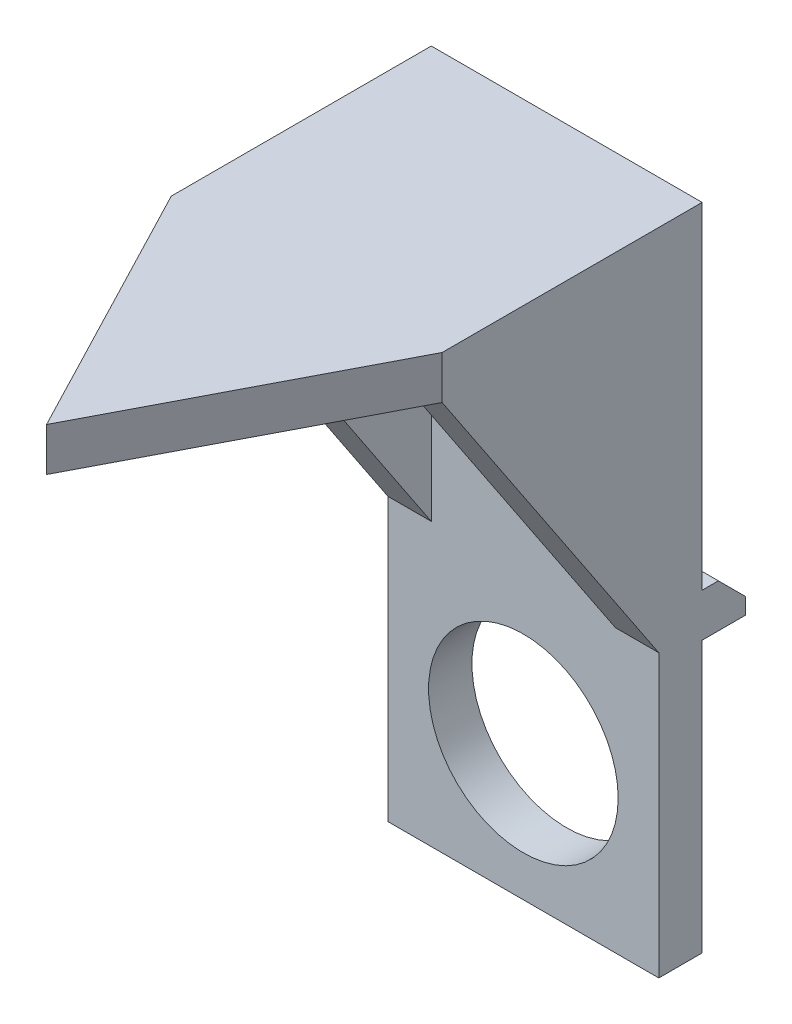
ISO-10303-21;
HEADER;
FILE_DESCRIPTION(('STEP AP214'),'2;1');
FILE_NAME('part.step','',(''),(''),'','','');
FILE_SCHEMA(('AUTOMOTIVE_DESIGN { 1 0 10303 214 1 1 1 1 }'));
ENDSEC;
DATA;
#1=APPLICATION_CONTEXT('core data for automotive mechanical design processes');
#2=APPLICATION_PROTOCOL_DEFINITION('international standard','automotive_design',2000,#1);
#3=PRODUCT_CONTEXT('',#1,'mechanical');
#4=PRODUCT('Part','Part','',(#3));
#5=PRODUCT_RELATED_PRODUCT_CATEGORY('part','',(#4));
#6=PRODUCT_DEFINITION_FORMATION('','',#4);
#7=PRODUCT_DEFINITION_CONTEXT('part definition',#1,'design');
#8=PRODUCT_DEFINITION('design','',#6,#7);
#9=PRODUCT_DEFINITION_SHAPE('','',#8);
#10=(LENGTH_UNIT() NAMED_UNIT(*) SI_UNIT(.MILLI.,.METRE.));
#11=(NAMED_UNIT(*) PLANE_ANGLE_UNIT() SI_UNIT($,.RADIAN.));
#12=(NAMED_UNIT(*) SI_UNIT($,.STERADIAN.) SOLID_ANGLE_UNIT());
#13=UNCERTAINTY_MEASURE_WITH_UNIT(LENGTH_MEASURE(1.E-05),#10,'distance_accuracy_value','');
#14=(GEOMETRIC_REPRESENTATION_CONTEXT(3) GLOBAL_UNCERTAINTY_ASSIGNED_CONTEXT((#13)) GLOBAL_UNIT_ASSIGNED_CONTEXT((#10,
#11,#12)) REPRESENTATION_CONTEXT('',''));
#15=CARTESIAN_POINT('',(0.,0.,0.));
#16=DIRECTION('',(0.,0.,1.));
#17=DIRECTION('',(1.,0.,0.));
#18=AXIS2_PLACEMENT_3D('',#15,#16,#17);
#19=CARTESIAN_POINT('',(0.,0.,0.));
#20=DIRECTION('',(0.,0.,1.));
#21=DIRECTION('',(1.,0.,0.));
#22=AXIS2_PLACEMENT_3D('',#19,#20,#21);
#23=PLANE('',#22);
#24=DIRECTION('',(1.,0.,0.));
#25=VECTOR('',#24,1.);
#26=CARTESIAN_POINT('',(5.00000000000002,6.59999999999999,0.));
#27=LINE('',#26,#25);
#28=CARTESIAN_POINT('',(-5.00000000000003,6.59999999999999,0.));
#29=VERTEX_POINT('',#28);
#30=CARTESIAN_POINT('',(5.00000000000002,6.59999999999999,0.));
#31=VERTEX_POINT('',#30);
#32=EDGE_CURVE('E244',#29,#31,#27,.T.);
#33=ORIENTED_EDGE('',*,*,#32,.F.);
#34=DIRECTION('',(0.,-1.,0.));
#35=VECTOR('',#34,1.);
#36=CARTESIAN_POINT('',(-5.00000000000004,19.,0.));
#37=LINE('',#36,#35);
#38=CARTESIAN_POINT('',(-5.00000000000004,19.,0.));
#39=VERTEX_POINT('',#38);
#40=EDGE_CURVE('E227',#39,#29,#37,.T.);
#41=ORIENTED_EDGE('',*,*,#40,.F.);
#42=DIRECTION('',(-1.,0.,0.));
#43=VECTOR('',#42,1.);
#44=CARTESIAN_POINT('',(-5.00000000000004,19.,0.));
#45=LINE('',#44,#43);
#46=CARTESIAN_POINT('',(5.,19.,0.));
#47=VERTEX_POINT('',#46);
#48=EDGE_CURVE('E273',#47,#39,#45,.T.);
#49=ORIENTED_EDGE('',*,*,#48,.F.);
#50=DIRECTION('',(0.,1.,0.));
#51=VECTOR('',#50,1.);
#52=CARTESIAN_POINT('',(5.,19.,0.));
#53=LINE('',#52,#51);
#54=EDGE_CURVE('E182',#31,#47,#53,.T.);
#55=ORIENTED_EDGE('',*,*,#54,.F.);
#56=EDGE_LOOP('',(#33,#41,#49,#55));
#57=FACE_BOUND('',#56,.T.);
#58=ADVANCED_FACE('F45',(#57),#23,.F.);
#59=CARTESIAN_POINT('',(0.,0.,0.));
#60=DIRECTION('',(0.,0.,1.));
#61=DIRECTION('',(1.,0.,0.));
#62=AXIS2_PLACEMENT_3D('',#59,#60,#61);
#63=CIRCLE('',#62,3.5);
#64=CARTESIAN_POINT('',(3.50000000000001,0.,0.));
#65=VERTEX_POINT('',#64);
#66=EDGE_CURVE('E253',#65,#65,#63,.T.);
#67=ORIENTED_EDGE('',*,*,#66,.T.);
#68=EDGE_LOOP('',(#67));
#69=FACE_BOUND('',#68,.T.);
#70=DIRECTION('',(-1.,0.,0.));
#71=VECTOR('',#70,1.);
#72=CARTESIAN_POINT('',(5.00000000000002,5.,0.));
#73=LINE('',#72,#71);
#74=CARTESIAN_POINT('',(5.00000000000002,5.,0.));
#75=VERTEX_POINT('',#74);
#76=CARTESIAN_POINT('',(-5.00000000000003,5.,0.));
#77=VERTEX_POINT('',#76);
#78=EDGE_CURVE('E250',#75,#77,#73,.T.);
#79=ORIENTED_EDGE('',*,*,#78,.F.);
#80=CARTESIAN_POINT('',(5.00000000000002,-5.00000000000001,0.));
#81=VERTEX_POINT('',#80);
#82=EDGE_CURVE('E284',#81,#75,#53,.T.);
#83=ORIENTED_EDGE('',*,*,#82,.F.);
#84=DIRECTION('',(1.,0.,0.));
#85=VECTOR('',#84,1.);
#86=CARTESIAN_POINT('',(-5.00000000000003,-5.,0.));
#87=LINE('',#86,#85);
#88=CARTESIAN_POINT('',(-5.00000000000003,-5.,0.));
#89=VERTEX_POINT('',#88);
#90=EDGE_CURVE('E281',#89,#81,#87,.T.);
#91=ORIENTED_EDGE('',*,*,#90,.F.);
#92=EDGE_CURVE('E268',#77,#89,#37,.T.);
#93=ORIENTED_EDGE('',*,*,#92,.F.);
#94=EDGE_LOOP('',(#79,#83,#91,#93));
#95=FACE_BOUND('',#94,.T.);
#96=ADVANCED_FACE('F308',(#69,#95),#23,.F.);
#97=CARTESIAN_POINT('',(-5.,19.,1.60000000000005));
#98=DIRECTION('',(1.,0.,0.));
#99=DIRECTION('',(0.,1.,0.));
#100=AXIS2_PLACEMENT_3D('',#97,#98,#99);
#101=PLANE('',#100);
#102=DIRECTION('',(0.,0.832050294337844,0.554700196225231));
#103=VECTOR('',#102,1.);
#104=CARTESIAN_POINT('',(-5.00000000000002,17.4,9.60000000000002));
#105=LINE('',#104,#103);
#106=CARTESIAN_POINT('',(-5.,5.4,1.60000000000005));
#107=VERTEX_POINT('',#106);
#108=CARTESIAN_POINT('',(-5.00000000000002,17.4,9.60000000000002));
#109=VERTEX_POINT('',#108);
#110=EDGE_CURVE('E322',#107,#109,#105,.T.);
#111=ORIENTED_EDGE('',*,*,#110,.T.);
#112=DIRECTION('',(0.,-1.,0.));
#113=VECTOR('',#112,1.);
#114=CARTESIAN_POINT('',(-5.00000000000002,19.,9.60000000000002));
#115=LINE('',#114,#113);
#116=CARTESIAN_POINT('',(-5.00000000000002,19.,9.60000000000002));
#117=VERTEX_POINT('',#116);
#118=EDGE_CURVE('E323',#117,#109,#115,.T.);
#119=ORIENTED_EDGE('',*,*,#118,.F.);
#120=DIRECTION('',(0.,0.,-1.));
#121=VECTOR('',#120,1.);
#122=CARTESIAN_POINT('',(-5.,19.,1.60000000000005));
#123=LINE('',#122,#121);
#124=EDGE_CURVE('E186',#117,#39,#123,.T.);
#125=ORIENTED_EDGE('',*,*,#124,.T.);
#126=ORIENTED_EDGE('',*,*,#40,.T.);
#127=DIRECTION('',(0.,0.,1.));
#128=VECTOR('',#127,1.);
#129=CARTESIAN_POINT('',(-5.00000000000004,6.59999999999999,-1.59999999999999));
#130=LINE('',#129,#128);
#131=CARTESIAN_POINT('',(-5.00000000000001,6.59999999999999,-0.599999999999962));
#132=VERTEX_POINT('',#131);
#133=EDGE_CURVE('E215',#132,#29,#130,.T.);
#134=ORIENTED_EDGE('',*,*,#133,.F.);
#135=DIRECTION('',(0.,-0.707106781186548,-0.707106781186549));
#136=VECTOR('',#135,1.);
#137=CARTESIAN_POINT('',(-4.99999999999998,5.59999999999999,-1.59999999999999));
#138=LINE('',#137,#136);
#139=CARTESIAN_POINT('',(-5.00000000000002,5.59999999999999,-1.59999999999999));
#140=VERTEX_POINT('',#139);
#141=EDGE_CURVE('E11',#132,#140,#138,.T.);
#142=ORIENTED_EDGE('',*,*,#141,.T.);
#143=DIRECTION('',(0.,1.,0.));
#144=VECTOR('',#143,1.);
#145=CARTESIAN_POINT('',(-5.00000000000004,6.59999999999999,-1.59999999999999));
#146=LINE('',#145,#144);
#147=CARTESIAN_POINT('',(-5.00000000000002,5.,-1.59999999999999));
#148=VERTEX_POINT('',#147);
#149=EDGE_CURVE('E237',#148,#140,#146,.T.);
#150=ORIENTED_EDGE('',*,*,#149,.F.);
#151=DIRECTION('',(0.,0.,1.));
#152=VECTOR('',#151,1.);
#153=CARTESIAN_POINT('',(-5.00000000000002,5.,-1.59999999999999));
#154=LINE('',#153,#152);
#155=EDGE_CURVE('E229',#148,#77,#154,.T.);
#156=ORIENTED_EDGE('',*,*,#155,.T.);
#157=ORIENTED_EDGE('',*,*,#92,.T.);
#158=DIRECTION('',(0.,0.,-1.));
#159=VECTOR('',#158,1.);
#160=CARTESIAN_POINT('',(-4.99999999999996,-5.,1.6000000000001));
#161=LINE('',#160,#159);
#162=CARTESIAN_POINT('',(-4.99999999999996,-5.,1.6000000000001));
#163=VERTEX_POINT('',#162);
#164=EDGE_CURVE('E192',#163,#89,#161,.T.);
#165=ORIENTED_EDGE('',*,*,#164,.F.);
#166=DIRECTION('',(0.,-1.,0.));
#167=VECTOR('',#166,1.);
#168=CARTESIAN_POINT('',(-5.,19.,1.60000000000005));
#169=LINE('',#168,#167);
#170=EDGE_CURVE('E269',#107,#163,#169,.T.);
#171=ORIENTED_EDGE('',*,*,#170,.F.);
#172=EDGE_LOOP('',(#111,#119,#125,#126,#134,#142,#150,#156,#157,#165,#171));
#173=FACE_BOUND('',#172,.T.);
#174=ADVANCED_FACE('F223',(#173),#101,.F.);
#175=CARTESIAN_POINT('',(-4.99999999999996,-5.,1.6000000000001));
#176=DIRECTION('',(0.,1.,0.));
#177=DIRECTION('',(0.,0.,1.));
#178=AXIS2_PLACEMENT_3D('',#175,#176,#177);
#179=PLANE('',#178);
#180=ORIENTED_EDGE('',*,*,#90,.T.);
#181=DIRECTION('',(0.,0.,-1.));
#182=VECTOR('',#181,1.);
#183=CARTESIAN_POINT('',(5.00000000000006,-5.00000000000001,1.6000000000001));
#184=LINE('',#183,#182);
#185=CARTESIAN_POINT('',(5.00000000000006,-5.00000000000001,1.6000000000001));
#186=VERTEX_POINT('',#185);
#187=EDGE_CURVE('E185',#186,#81,#184,.T.);
#188=ORIENTED_EDGE('',*,*,#187,.F.);
#189=DIRECTION('',(1.,0.,0.));
#190=VECTOR('',#189,1.);
#191=CARTESIAN_POINT('',(-4.99999999999996,-5.,1.6000000000001));
#192=LINE('',#191,#190);
#193=EDGE_CURVE('E272',#163,#186,#192,.T.);
#194=ORIENTED_EDGE('',*,*,#193,.F.);
#195=ORIENTED_EDGE('',*,*,#164,.T.);
#196=EDGE_LOOP('',(#180,#188,#194,#195));
#197=FACE_BOUND('',#196,.T.);
#198=ADVANCED_FACE('F312',(#197),#179,.F.);
#199=CARTESIAN_POINT('',(5.00000000000002,19.,1.60000000000013));
#200=DIRECTION('',(-1.,0.,0.));
#201=DIRECTION('',(0.,-1.,0.));
#202=AXIS2_PLACEMENT_3D('',#199,#200,#201);
#203=PLANE('',#202);
#204=DIRECTION('',(0.,0.,-1.));
#205=VECTOR('',#204,1.);
#206=CARTESIAN_POINT('',(5.00000000000002,19.,1.60000000000013));
#207=LINE('',#206,#205);
#208=CARTESIAN_POINT('',(5.00000000000002,19.,9.60000000000014));
#209=VERTEX_POINT('',#208);
#210=EDGE_CURVE('E174',#209,#47,#207,.T.);
#211=ORIENTED_EDGE('',*,*,#210,.F.);
#212=DIRECTION('',(0.,-1.,0.));
#213=VECTOR('',#212,1.);
#214=CARTESIAN_POINT('',(5.00000000000002,19.,9.60000000000014));
#215=LINE('',#214,#213);
#216=CARTESIAN_POINT('',(5.00000000000002,17.4,9.60000000000014));
#217=VERTEX_POINT('',#216);
#218=EDGE_CURVE('E156',#209,#217,#215,.T.);
#219=ORIENTED_EDGE('',*,*,#218,.T.);
#220=DIRECTION('',(0.,0.832050294337844,0.554700196225231));
#221=VECTOR('',#220,1.);
#222=CARTESIAN_POINT('',(5.00000000000002,17.4,9.60000000000014));
#223=LINE('',#222,#221);
#224=CARTESIAN_POINT('',(5.00000000000005,5.4,1.60000000000007));
#225=VERTEX_POINT('',#224);
#226=EDGE_CURVE('E328',#225,#217,#223,.T.);
#227=ORIENTED_EDGE('',*,*,#226,.F.);
#228=DIRECTION('',(0.,1.,0.));
#229=VECTOR('',#228,1.);
#230=CARTESIAN_POINT('',(5.00000000000002,19.,1.60000000000013));
#231=LINE('',#230,#229);
#232=EDGE_CURVE('E194',#186,#225,#231,.T.);
#233=ORIENTED_EDGE('',*,*,#232,.F.);
#234=ORIENTED_EDGE('',*,*,#187,.T.);
#235=ORIENTED_EDGE('',*,*,#82,.T.);
#236=DIRECTION('',(0.,0.,1.));
#237=VECTOR('',#236,1.);
#238=CARTESIAN_POINT('',(5.,5.,-1.59999999999999));
#239=LINE('',#238,#237);
#240=CARTESIAN_POINT('',(5.,5.,-1.59999999999999));
#241=VERTEX_POINT('',#240);
#242=EDGE_CURVE('E241',#241,#75,#239,.T.);
#243=ORIENTED_EDGE('',*,*,#242,.F.);
#244=DIRECTION('',(0.,-1.,0.));
#245=VECTOR('',#244,1.);
#246=CARTESIAN_POINT('',(5.,6.59999999999999,-1.59999999999996));
#247=LINE('',#246,#245);
#248=CARTESIAN_POINT('',(5.,5.59999999999999,-1.59999999999999));
#249=VERTEX_POINT('',#248);
#250=EDGE_CURVE('E235',#249,#241,#247,.T.);
#251=ORIENTED_EDGE('',*,*,#250,.F.);
#252=DIRECTION('',(0.,0.707106781186548,0.707106781186549));
#253=VECTOR('',#252,1.);
#254=CARTESIAN_POINT('',(5.,5.59999999999999,-1.59999999999999));
#255=LINE('',#254,#253);
#256=CARTESIAN_POINT('',(5.00000000000005,6.59999999999999,-0.599999999999934));
#257=VERTEX_POINT('',#256);
#258=EDGE_CURVE('E205',#249,#257,#255,.T.);
#259=ORIENTED_EDGE('',*,*,#258,.T.);
#260=DIRECTION('',(0.,0.,1.));
#261=VECTOR('',#260,1.);
#262=CARTESIAN_POINT('',(5.,6.59999999999999,-1.59999999999996));
#263=LINE('',#262,#261);
#264=EDGE_CURVE('E217',#257,#31,#263,.T.);
#265=ORIENTED_EDGE('',*,*,#264,.T.);
#266=ORIENTED_EDGE('',*,*,#54,.T.);
#267=EDGE_LOOP('',(#211,#219,#227,#233,#234,#235,#243,#251,#259,#265,#266));
#268=FACE_BOUND('',#267,.T.);
#269=ADVANCED_FACE('F180',(#268),#203,.F.);
#270=CARTESIAN_POINT('',(-5.,19.,1.60000000000005));
#271=DIRECTION('',(0.,-1.,0.));
#272=DIRECTION('',(0.,0.,-1.));
#273=AXIS2_PLACEMENT_3D('',#270,#271,#272);
#274=PLANE('',#273);
#275=DIRECTION('',(0.461748613233364,0.,0.887010833179093));
#276=VECTOR('',#275,1.);
#277=CARTESIAN_POINT('',(-7.86587090346212,19.,4.09471321621724));
#278=LINE('',#277,#276);
#279=CARTESIAN_POINT('',(0.,19.,19.2049106349001));
#280=VERTEX_POINT('',#279);
#281=EDGE_CURVE('E177',#117,#280,#278,.T.);
#282=ORIENTED_EDGE('',*,*,#281,.T.);
#283=DIRECTION('',(0.461748613233365,0.,-0.887010833179094));
#284=VECTOR('',#283,1.);
#285=CARTESIAN_POINT('',(7.86587090346213,19.,4.09471321621732));
#286=LINE('',#285,#284);
#287=EDGE_CURVE('E159',#280,#209,#286,.T.);
#288=ORIENTED_EDGE('',*,*,#287,.T.);
#289=ORIENTED_EDGE('',*,*,#210,.T.);
#290=ORIENTED_EDGE('',*,*,#48,.T.);
#291=ORIENTED_EDGE('',*,*,#124,.F.);
#292=EDGE_LOOP('',(#282,#288,#289,#290,#291));
#293=FACE_BOUND('',#292,.T.);
#294=ADVANCED_FACE('F172',(#293),#274,.F.);
#295=CARTESIAN_POINT('',(0.,0.,1.60000000000002));
#296=DIRECTION('',(0.,0.,1.));
#297=DIRECTION('',(1.,0.,0.));
#298=AXIS2_PLACEMENT_3D('',#295,#296,#297);
#299=PLANE('',#298);
#300=DIRECTION('',(1.,0.,0.));
#301=VECTOR('',#300,1.);
#302=CARTESIAN_POINT('',(3.40000000000005,5.4,1.60000000000013));
#303=LINE('',#302,#301);
#304=CARTESIAN_POINT('',(3.40000000000003,5.4,1.60000000000005));
#305=VERTEX_POINT('',#304);
#306=EDGE_CURVE('E361',#305,#225,#303,.T.);
#307=ORIENTED_EDGE('',*,*,#306,.F.);
#308=DIRECTION('',(0.,-1.,0.));
#309=VECTOR('',#308,1.);
#310=CARTESIAN_POINT('',(3.40000000000003,17.4,1.60000000000005));
#311=LINE('',#310,#309);
#312=CARTESIAN_POINT('',(3.40000000000003,17.4,1.60000000000005));
#313=VERTEX_POINT('',#312);
#314=EDGE_CURVE('E358',#313,#305,#311,.T.);
#315=ORIENTED_EDGE('',*,*,#314,.F.);
#316=DIRECTION('',(1.,0.,0.));
#317=VECTOR('',#316,1.);
#318=CARTESIAN_POINT('',(-3.4,17.4,1.6000000000001));
#319=LINE('',#318,#317);
#320=CARTESIAN_POINT('',(-3.4,17.4,1.6000000000001));
#321=VERTEX_POINT('',#320);
#322=EDGE_CURVE('E355',#321,#313,#319,.T.);
#323=ORIENTED_EDGE('',*,*,#322,.F.);
#324=DIRECTION('',(0.,1.,0.));
#325=VECTOR('',#324,1.);
#326=CARTESIAN_POINT('',(-3.4,5.4,1.6000000000001));
#327=LINE('',#326,#325);
#328=CARTESIAN_POINT('',(-3.4,5.4,1.6000000000001));
#329=VERTEX_POINT('',#328);
#330=EDGE_CURVE('E351',#329,#321,#327,.T.);
#331=ORIENTED_EDGE('',*,*,#330,.F.);
#332=DIRECTION('',(1.,0.,0.));
#333=VECTOR('',#332,1.);
#334=CARTESIAN_POINT('',(-4.99999999999996,5.4,1.6000000000001));
#335=LINE('',#334,#333);
#336=EDGE_CURVE('E320',#107,#329,#335,.T.);
#337=ORIENTED_EDGE('',*,*,#336,.F.);
#338=ORIENTED_EDGE('',*,*,#170,.T.);
#339=ORIENTED_EDGE('',*,*,#193,.T.);
#340=ORIENTED_EDGE('',*,*,#232,.T.);
#341=EDGE_LOOP('',(#307,#315,#323,#331,#337,#338,#339,#340));
#342=FACE_BOUND('',#341,.T.);
#343=CARTESIAN_POINT('',(0.,0.,1.60000000000002));
#344=DIRECTION('',(0.,0.,1.));
#345=DIRECTION('',(1.,0.,0.));
#346=AXIS2_PLACEMENT_3D('',#343,#344,#345);
#347=CIRCLE('',#346,3.5);
#348=CARTESIAN_POINT('',(3.50000000000004,0.,1.60000000000002));
#349=VERTEX_POINT('',#348);
#350=EDGE_CURVE('E367',#349,#349,#347,.T.);
#351=ORIENTED_EDGE('',*,*,#350,.F.);
#352=EDGE_LOOP('',(#351));
#353=FACE_BOUND('',#352,.T.);
#354=ADVANCED_FACE('F316',(#342,#353),#299,.T.);
#355=CARTESIAN_POINT('',(5.,5.,-1.59999999999999));
#356=DIRECTION('',(0.,1.,0.));
#357=DIRECTION('',(-1.,0.,0.));
#358=AXIS2_PLACEMENT_3D('',#355,#356,#357);
#359=PLANE('',#358);
#360=ORIENTED_EDGE('',*,*,#78,.T.);
#361=ORIENTED_EDGE('',*,*,#155,.F.);
#362=DIRECTION('',(-1.,0.,0.));
#363=VECTOR('',#362,1.);
#364=CARTESIAN_POINT('',(5.,5.,-1.59999999999999));
#365=LINE('',#364,#363);
#366=EDGE_CURVE('E243',#241,#148,#365,.T.);
#367=ORIENTED_EDGE('',*,*,#366,.F.);
#368=ORIENTED_EDGE('',*,*,#242,.T.);
#369=EDGE_LOOP('',(#360,#361,#367,#368));
#370=FACE_BOUND('',#369,.T.);
#371=ADVANCED_FACE('F434',(#370),#359,.F.);
#372=CARTESIAN_POINT('',(5.,6.59999999999999,-1.59999999999996));
#373=DIRECTION('',(0.,-1.,0.));
#374=DIRECTION('',(1.,0.,0.));
#375=AXIS2_PLACEMENT_3D('',#372,#373,#374);
#376=PLANE('',#375);
#377=ORIENTED_EDGE('',*,*,#264,.F.);
#378=DIRECTION('',(-1.,0.,0.));
#379=VECTOR('',#378,1.);
#380=CARTESIAN_POINT('',(-5.00000000000001,6.59999999999999,-0.599999999999962));
#381=LINE('',#380,#379);
#382=EDGE_CURVE('E55',#257,#132,#381,.T.);
#383=ORIENTED_EDGE('',*,*,#382,.T.);
#384=ORIENTED_EDGE('',*,*,#133,.T.);
#385=ORIENTED_EDGE('',*,*,#32,.T.);
#386=EDGE_LOOP('',(#377,#383,#384,#385));
#387=FACE_BOUND('',#386,.T.);
#388=ADVANCED_FACE('F213',(#387),#376,.F.);
#389=CARTESIAN_POINT('',(0.,0.,-1.59999999999996));
#390=DIRECTION('',(0.,0.,-1.));
#391=DIRECTION('',(-1.,0.,0.));
#392=AXIS2_PLACEMENT_3D('',#389,#390,#391);
#393=PLANE('',#392);
#394=ORIENTED_EDGE('',*,*,#149,.T.);
#395=DIRECTION('',(1.,0.,0.));
#396=VECTOR('',#395,1.);
#397=CARTESIAN_POINT('',(5.,5.59999999999999,-1.59999999999999));
#398=LINE('',#397,#396);
#399=EDGE_CURVE('E201',#140,#249,#398,.T.);
#400=ORIENTED_EDGE('',*,*,#399,.T.);
#401=ORIENTED_EDGE('',*,*,#250,.T.);
#402=ORIENTED_EDGE('',*,*,#366,.T.);
#403=EDGE_LOOP('',(#394,#400,#401,#402));
#404=FACE_BOUND('',#403,.T.);
#405=ADVANCED_FACE('F234',(#404),#393,.T.);
#406=CARTESIAN_POINT('',(0.,5.59999999999999,-1.59999999999996));
#407=DIRECTION('',(0.,0.707106781186547,-0.707106781186549));
#408=DIRECTION('',(-1.,0.,0.));
#409=AXIS2_PLACEMENT_3D('',#406,#407,#408);
#410=PLANE('',#409);
#411=ORIENTED_EDGE('',*,*,#141,.F.);
#412=ORIENTED_EDGE('',*,*,#382,.F.);
#413=ORIENTED_EDGE('',*,*,#258,.F.);
#414=ORIENTED_EDGE('',*,*,#399,.F.);
#415=EDGE_LOOP('',(#411,#412,#413,#414));
#416=FACE_BOUND('',#415,.T.);
#417=ADVANCED_FACE('F48',(#416),#410,.T.);
#418=CARTESIAN_POINT('',(0.,0.,-1.59999999999996));
#419=DIRECTION('',(0.,0.,1.));
#420=DIRECTION('',(1.,0.,0.));
#421=AXIS2_PLACEMENT_3D('',#418,#419,#420);
#422=CYLINDRICAL_SURFACE('',#421,3.5);
#423=ORIENTED_EDGE('',*,*,#350,.T.);
#424=EDGE_LOOP('',(#423));
#425=FACE_BOUND('',#424,.T.);
#426=ORIENTED_EDGE('',*,*,#66,.F.);
#427=EDGE_LOOP('',(#426));
#428=FACE_BOUND('',#427,.T.);
#429=ADVANCED_FACE('F379',(#425,#428),#422,.F.);
#430=CARTESIAN_POINT('',(-3.39999999999998,5.4,19.2049106349));
#431=DIRECTION('',(-1.,0.,0.));
#432=DIRECTION('',(0.,0.,1.));
#433=AXIS2_PLACEMENT_3D('',#430,#431,#432);
#434=PLANE('',#433);
#435=DIRECTION('',(0.,0.,-1.));
#436=VECTOR('',#435,1.);
#437=CARTESIAN_POINT('',(-3.40000000000004,17.4,19.2049106349002));
#438=LINE('',#437,#436);
#439=CARTESIAN_POINT('',(-3.40000000000001,17.4,9.60000000000002));
#440=VERTEX_POINT('',#439);
#441=EDGE_CURVE('E70',#440,#321,#438,.T.);
#442=ORIENTED_EDGE('',*,*,#441,.F.);
#443=DIRECTION('',(0.,-0.832050294337844,-0.554700196225231));
#444=VECTOR('',#443,1.);
#445=CARTESIAN_POINT('',(-3.39999999999998,13.5253433699538,7.01689557996929));
#446=LINE('',#445,#444);
#447=EDGE_CURVE('E345',#440,#329,#446,.T.);
#448=ORIENTED_EDGE('',*,*,#447,.T.);
#449=ORIENTED_EDGE('',*,*,#330,.T.);
#450=EDGE_LOOP('',(#442,#448,#449));
#451=FACE_BOUND('',#450,.T.);
#452=ADVANCED_FACE('F381',(#451),#434,.F.);
#453=CARTESIAN_POINT('',(-3.40000000000004,17.4,19.2049106349002));
#454=DIRECTION('',(0.,1.,0.));
#455=DIRECTION('',(0.,0.,1.));
#456=AXIS2_PLACEMENT_3D('',#453,#454,#455);
#457=PLANE('',#456);
#458=DIRECTION('',(1.,0.,0.));
#459=VECTOR('',#458,1.);
#460=CARTESIAN_POINT('',(-5.00000000000002,17.4,9.60000000000002));
#461=LINE('',#460,#459);
#462=CARTESIAN_POINT('',(3.40000000000003,17.4,9.60000000000008));
#463=VERTEX_POINT('',#462);
#464=EDGE_CURVE('E327',#463,#217,#461,.T.);
#465=ORIENTED_EDGE('',*,*,#464,.T.);
#466=DIRECTION('',(0.461748613233365,0.,-0.887010833179094));
#467=VECTOR('',#466,1.);
#468=CARTESIAN_POINT('',(7.86587090346214,17.4,4.09471321621729));
#469=LINE('',#468,#467);
#470=CARTESIAN_POINT('',(0.,17.4,19.2049106349001));
#471=VERTEX_POINT('',#470);
#472=EDGE_CURVE('E162',#471,#217,#469,.T.);
#473=ORIENTED_EDGE('',*,*,#472,.F.);
#474=DIRECTION('',(0.461748613233364,0.,0.887010833179093));
#475=VECTOR('',#474,1.);
#476=CARTESIAN_POINT('',(-7.86587090346212,17.4,4.09471321621724));
#477=LINE('',#476,#475);
#478=EDGE_CURVE('E168',#109,#471,#477,.T.);
#479=ORIENTED_EDGE('',*,*,#478,.F.);
#480=EDGE_CURVE('E333',#109,#440,#461,.T.);
#481=ORIENTED_EDGE('',*,*,#480,.T.);
#482=ORIENTED_EDGE('',*,*,#441,.T.);
#483=ORIENTED_EDGE('',*,*,#322,.T.);
#484=DIRECTION('',(0.,0.,-1.));
#485=VECTOR('',#484,1.);
#486=CARTESIAN_POINT('',(3.40000000000001,17.4,19.2049106349002));
#487=LINE('',#486,#485);
#488=EDGE_CURVE('E62',#463,#313,#487,.T.);
#489=ORIENTED_EDGE('',*,*,#488,.F.);
#490=EDGE_LOOP('',(#465,#473,#479,#481,#482,#483,#489));
#491=FACE_BOUND('',#490,.T.);
#492=ADVANCED_FACE('F387',(#491),#457,.F.);
#493=CARTESIAN_POINT('',(3.40000000000001,17.4,19.2049106349002));
#494=DIRECTION('',(1.,0.,0.));
#495=DIRECTION('',(0.,1.,0.));
#496=AXIS2_PLACEMENT_3D('',#493,#494,#495);
#497=PLANE('',#496);
#498=ORIENTED_EDGE('',*,*,#314,.T.);
#499=DIRECTION('',(0.,0.832050294337844,0.554700196225231));
#500=VECTOR('',#499,1.);
#501=CARTESIAN_POINT('',(3.40000000000002,21.8330356776462,12.5553571184308));
#502=LINE('',#501,#500);
#503=EDGE_CURVE('E342',#305,#463,#502,.T.);
#504=ORIENTED_EDGE('',*,*,#503,.T.);
#505=ORIENTED_EDGE('',*,*,#488,.T.);
#506=EDGE_LOOP('',(#498,#504,#505));
#507=FACE_BOUND('',#506,.T.);
#508=ADVANCED_FACE('F477',(#507),#497,.F.);
#509=CARTESIAN_POINT('',(-5.00000000000002,17.4,9.60000000000002));
#510=DIRECTION('',(0.,0.554700196225229,-0.832050294337846));
#511=DIRECTION('',(0.,0.832050294337844,0.554700196225231));
#512=AXIS2_PLACEMENT_3D('',#509,#510,#511);
#513=PLANE('',#512);
#514=ORIENTED_EDGE('',*,*,#480,.F.);
#515=ORIENTED_EDGE('',*,*,#110,.F.);
#516=ORIENTED_EDGE('',*,*,#336,.T.);
#517=ORIENTED_EDGE('',*,*,#447,.F.);
#518=EDGE_LOOP('',(#514,#515,#516,#517));
#519=FACE_BOUND('',#518,.T.);
#520=ADVANCED_FACE('F486',(#519),#513,.F.);
#521=ORIENTED_EDGE('',*,*,#306,.T.);
#522=ORIENTED_EDGE('',*,*,#226,.T.);
#523=ORIENTED_EDGE('',*,*,#464,.F.);
#524=ORIENTED_EDGE('',*,*,#503,.F.);
#525=EDGE_LOOP('',(#521,#522,#523,#524));
#526=FACE_BOUND('',#525,.T.);
#527=ADVANCED_FACE('F494',(#526),#513,.F.);
#528=CARTESIAN_POINT('',(-7.86587090346212,19.,4.09471321621724));
#529=DIRECTION('',(0.887010833179093,0.,-0.461748613233364));
#530=DIRECTION('',(-0.461748613233364,0.,-0.887010833179093));
#531=AXIS2_PLACEMENT_3D('',#528,#529,#530);
#532=PLANE('',#531);
#533=ORIENTED_EDGE('',*,*,#478,.T.);
#534=DIRECTION('',(0.,-1.,0.));
#535=VECTOR('',#534,1.);
#536=CARTESIAN_POINT('',(0.,19.,19.2049106349001));
#537=LINE('',#536,#535);
#538=EDGE_CURVE('E336',#280,#471,#537,.T.);
#539=ORIENTED_EDGE('',*,*,#538,.F.);
#540=ORIENTED_EDGE('',*,*,#281,.F.);
#541=ORIENTED_EDGE('',*,*,#118,.T.);
#542=EDGE_LOOP('',(#533,#539,#540,#541));
#543=FACE_BOUND('',#542,.T.);
#544=ADVANCED_FACE('F502',(#543),#532,.F.);
#545=CARTESIAN_POINT('',(7.86587090346213,19.,4.09471321621732));
#546=DIRECTION('',(-0.887010833179093,0.,-0.461748613233364));
#547=DIRECTION('',(-0.461748613233365,0.,0.887010833179094));
#548=AXIS2_PLACEMENT_3D('',#545,#546,#547);
#549=PLANE('',#548);
#550=ORIENTED_EDGE('',*,*,#472,.T.);
#551=ORIENTED_EDGE('',*,*,#218,.F.);
#552=ORIENTED_EDGE('',*,*,#287,.F.);
#553=ORIENTED_EDGE('',*,*,#538,.T.);
#554=EDGE_LOOP('',(#550,#551,#552,#553));
#555=FACE_BOUND('',#554,.T.);
#556=ADVANCED_FACE('F158',(#555),#549,.F.);
#557=CLOSED_SHELL('',(#58,#96,#174,#198,#269,#294,#354,#371,#388,#405,#417,#429,#452,#492,#508,
#520,#527,#544,#556));
#558=MANIFOLD_SOLID_BREP('B2',#557);
#559=ADVANCED_BREP_SHAPE_REPRESENTATION('',(#18,#558),#14);
#560=SHAPE_DEFINITION_REPRESENTATION(#9,#559);
ENDSEC;
END-ISO-10303-21;
